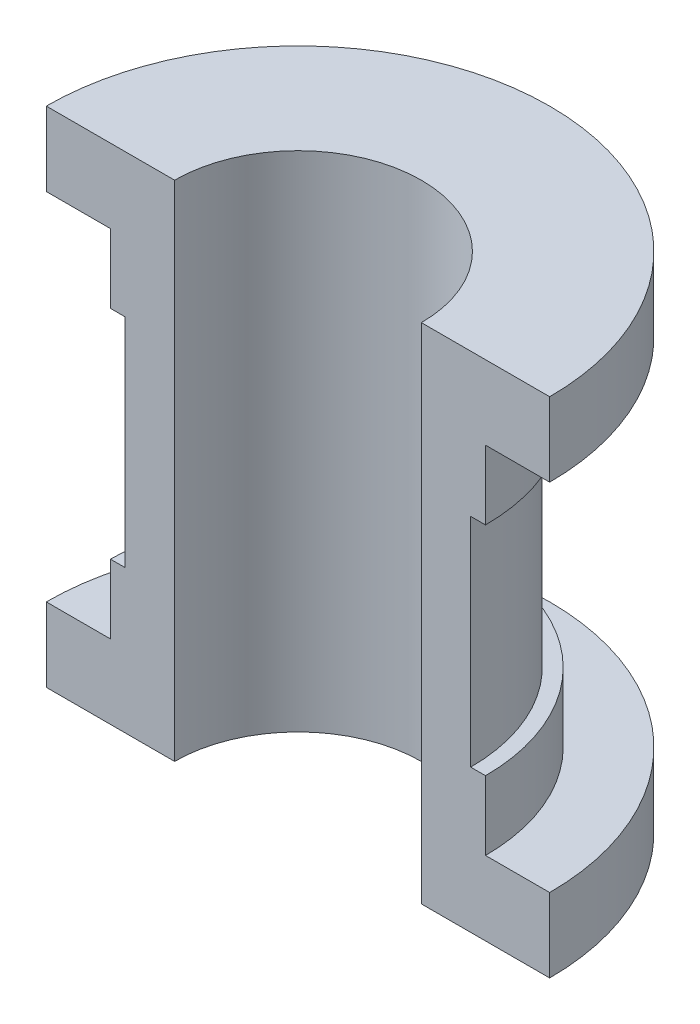
ISO-10303-21;
HEADER;
FILE_DESCRIPTION(('STEP AP214'),'2;1');
FILE_NAME('part.step','',(''),(''),'','','');
FILE_SCHEMA(('AUTOMOTIVE_DESIGN { 1 0 10303 214 1 1 1 1 }'));
ENDSEC;
DATA;
#1=APPLICATION_CONTEXT('core data for automotive mechanical design processes');
#2=APPLICATION_PROTOCOL_DEFINITION('international standard','automotive_design',2000,#1);
#3=PRODUCT_CONTEXT('',#1,'mechanical');
#4=PRODUCT('Part','Part','',(#3));
#5=PRODUCT_RELATED_PRODUCT_CATEGORY('part','',(#4));
#6=PRODUCT_DEFINITION_FORMATION('','',#4);
#7=PRODUCT_DEFINITION_CONTEXT('part definition',#1,'design');
#8=PRODUCT_DEFINITION('design','',#6,#7);
#9=PRODUCT_DEFINITION_SHAPE('','',#8);
#10=(LENGTH_UNIT() NAMED_UNIT(*) SI_UNIT(.MILLI.,.METRE.));
#11=(NAMED_UNIT(*) PLANE_ANGLE_UNIT() SI_UNIT($,.RADIAN.));
#12=(NAMED_UNIT(*) SI_UNIT($,.STERADIAN.) SOLID_ANGLE_UNIT());
#13=UNCERTAINTY_MEASURE_WITH_UNIT(LENGTH_MEASURE(1.E-05),#10,'distance_accuracy_value','');
#14=(GEOMETRIC_REPRESENTATION_CONTEXT(3) GLOBAL_UNCERTAINTY_ASSIGNED_CONTEXT((#13)) GLOBAL_UNIT_ASSIGNED_CONTEXT((#10,
#11,#12)) REPRESENTATION_CONTEXT('',''));
#15=CARTESIAN_POINT('',(0.,0.,0.));
#16=DIRECTION('',(0.,0.,1.));
#17=DIRECTION('',(1.,0.,0.));
#18=AXIS2_PLACEMENT_3D('',#15,#16,#17);
#19=CARTESIAN_POINT('',(0.,0.,0.));
#20=DIRECTION('',(0.,0.,-1.));
#21=DIRECTION('',(-1.,0.,0.));
#22=AXIS2_PLACEMENT_3D('',#19,#20,#21);
#23=PLANE('',#22);
#24=DIRECTION('',(-1.,0.,0.));
#25=VECTOR('',#24,1.);
#26=CARTESIAN_POINT('',(0.,0.,0.));
#27=LINE('',#26,#25);
#28=CARTESIAN_POINT('',(-12.5,0.,1.32676290876039E-13));
#29=VERTEX_POINT('',#28);
#30=CARTESIAN_POINT('',(-25.5,0.,1.78065548281E-13));
#31=VERTEX_POINT('',#30);
#32=EDGE_CURVE('E134',#29,#31,#27,.T.);
#33=ORIENTED_EDGE('',*,*,#32,.F.);
#34=DIRECTION('',(0.,1.,0.));
#35=VECTOR('',#34,1.);
#36=CARTESIAN_POINT('',(-12.5,0.,1.32676290876039E-13));
#37=LINE('',#36,#35);
#38=CARTESIAN_POINT('',(-12.5,51.,1.32676290876039E-13));
#39=VERTEX_POINT('',#38);
#40=EDGE_CURVE('E122',#29,#39,#37,.T.);
#41=ORIENTED_EDGE('',*,*,#40,.T.);
#42=DIRECTION('',(1.,0.,0.));
#43=VECTOR('',#42,1.);
#44=CARTESIAN_POINT('',(-25.5,51.,1.78065548281E-13));
#45=LINE('',#44,#43);
#46=CARTESIAN_POINT('',(-25.5,51.,1.78065548281E-13));
#47=VERTEX_POINT('',#46);
#48=EDGE_CURVE('E174',#47,#39,#45,.T.);
#49=ORIENTED_EDGE('',*,*,#48,.F.);
#50=DIRECTION('',(0.,1.,0.));
#51=VECTOR('',#50,1.);
#52=CARTESIAN_POINT('',(-25.5,43.5,1.78065548281E-13));
#53=LINE('',#52,#51);
#54=CARTESIAN_POINT('',(-25.5,43.5,1.78065548281E-13));
#55=VERTEX_POINT('',#54);
#56=EDGE_CURVE('E171',#55,#47,#53,.T.);
#57=ORIENTED_EDGE('',*,*,#56,.F.);
#58=DIRECTION('',(-1.,0.,0.));
#59=VECTOR('',#58,1.);
#60=CARTESIAN_POINT('',(-19.,43.5,1.32676290876039E-13));
#61=LINE('',#60,#59);
#62=CARTESIAN_POINT('',(-19.,43.5,1.32676290876039E-13));
#63=VERTEX_POINT('',#62);
#64=EDGE_CURVE('E168',#63,#55,#61,.T.);
#65=ORIENTED_EDGE('',*,*,#64,.F.);
#66=DIRECTION('',(0.,1.,0.));
#67=VECTOR('',#66,1.);
#68=CARTESIAN_POINT('',(-19.,36.5,1.32676290876039E-13));
#69=LINE('',#68,#67);
#70=CARTESIAN_POINT('',(-19.,36.5,1.32676290876039E-13));
#71=VERTEX_POINT('',#70);
#72=EDGE_CURVE('E165',#71,#63,#69,.T.);
#73=ORIENTED_EDGE('',*,*,#72,.F.);
#74=DIRECTION('',(-1.,0.,0.));
#75=VECTOR('',#74,1.);
#76=CARTESIAN_POINT('',(-17.5,36.5,1.2220184685951E-13));
#77=LINE('',#76,#75);
#78=CARTESIAN_POINT('',(-17.5,36.5,1.2220184685951E-13));
#79=VERTEX_POINT('',#78);
#80=EDGE_CURVE('E162',#79,#71,#77,.T.);
#81=ORIENTED_EDGE('',*,*,#80,.F.);
#82=DIRECTION('',(0.,1.,0.));
#83=VECTOR('',#82,1.);
#84=CARTESIAN_POINT('',(-17.5,14.5,1.2220184685951E-13));
#85=LINE('',#84,#83);
#86=CARTESIAN_POINT('',(-17.5,14.5,1.2220184685951E-13));
#87=VERTEX_POINT('',#86);
#88=EDGE_CURVE('E159',#87,#79,#85,.T.);
#89=ORIENTED_EDGE('',*,*,#88,.F.);
#90=DIRECTION('',(1.,0.,0.));
#91=VECTOR('',#90,1.);
#92=CARTESIAN_POINT('',(-19.,14.5,1.32676290876039E-13));
#93=LINE('',#92,#91);
#94=CARTESIAN_POINT('',(-19.,14.5,1.32676290876039E-13));
#95=VERTEX_POINT('',#94);
#96=EDGE_CURVE('E156',#95,#87,#93,.T.);
#97=ORIENTED_EDGE('',*,*,#96,.F.);
#98=DIRECTION('',(0.,1.,0.));
#99=VECTOR('',#98,1.);
#100=CARTESIAN_POINT('',(-19.,7.5,1.32676290876039E-13));
#101=LINE('',#100,#99);
#102=CARTESIAN_POINT('',(-19.,7.5,1.32676290876039E-13));
#103=VERTEX_POINT('',#102);
#104=EDGE_CURVE('E153',#103,#95,#101,.T.);
#105=ORIENTED_EDGE('',*,*,#104,.F.);
#106=DIRECTION('',(1.,0.,0.));
#107=VECTOR('',#106,1.);
#108=CARTESIAN_POINT('',(-25.5,7.5,1.78065548281E-13));
#109=LINE('',#108,#107);
#110=CARTESIAN_POINT('',(-25.5,7.5,1.78065548281E-13));
#111=VERTEX_POINT('',#110);
#112=EDGE_CURVE('E150',#111,#103,#109,.T.);
#113=ORIENTED_EDGE('',*,*,#112,.F.);
#114=DIRECTION('',(0.,1.,0.));
#115=VECTOR('',#114,1.);
#116=CARTESIAN_POINT('',(-25.5,0.,1.78065548281E-13));
#117=LINE('',#116,#115);
#118=EDGE_CURVE('E141',#31,#111,#117,.T.);
#119=ORIENTED_EDGE('',*,*,#118,.F.);
#120=EDGE_LOOP('',(#33,#41,#49,#57,#65,#73,#81,#89,#97,#105,#113,#119));
#121=FACE_BOUND('',#120,.T.);
#122=ADVANCED_FACE('F33',(#121),#23,.F.);
#123=CARTESIAN_POINT('',(0.,0.,0.));
#124=DIRECTION('',(0.,-1.,0.));
#125=DIRECTION('',(0.,0.,-1.));
#126=AXIS2_PLACEMENT_3D('',#123,#124,#125);
#127=PLANE('',#126);
#128=CARTESIAN_POINT('',(0.,0.,0.));
#129=DIRECTION('',(0.,1.,0.));
#130=DIRECTION('',(0.,0.,1.));
#131=AXIS2_PLACEMENT_3D('',#128,#129,#130);
#132=CIRCLE('',#131,12.5);
#133=CARTESIAN_POINT('',(12.5,0.,0.));
#134=VERTEX_POINT('',#133);
#135=EDGE_CURVE('E49',#134,#29,#132,.T.);
#136=ORIENTED_EDGE('',*,*,#135,.T.);
#137=ORIENTED_EDGE('',*,*,#32,.T.);
#138=CARTESIAN_POINT('',(0.,0.,0.));
#139=DIRECTION('',(0.,-1.,0.));
#140=DIRECTION('',(0.,0.,-1.));
#141=AXIS2_PLACEMENT_3D('',#138,#139,#140);
#142=CIRCLE('',#141,25.5);
#143=CARTESIAN_POINT('',(25.5,0.,0.));
#144=VERTEX_POINT('',#143);
#145=EDGE_CURVE('E37',#31,#144,#142,.T.);
#146=ORIENTED_EDGE('',*,*,#145,.T.);
#147=EDGE_CURVE('E136',#144,#134,#27,.T.);
#148=ORIENTED_EDGE('',*,*,#147,.T.);
#149=EDGE_LOOP('',(#136,#137,#146,#148));
#150=FACE_BOUND('',#149,.T.);
#151=ADVANCED_FACE('F35',(#150),#127,.T.);
#152=CARTESIAN_POINT('',(0.,0.,0.));
#153=DIRECTION('',(0.,-1.,0.));
#154=DIRECTION('',(0.,0.,-1.));
#155=AXIS2_PLACEMENT_3D('',#152,#153,#154);
#156=CYLINDRICAL_SURFACE('',#155,25.5);
#157=CARTESIAN_POINT('',(0.,7.5,0.));
#158=DIRECTION('',(0.,-1.,0.));
#159=DIRECTION('',(0.,0.,-1.));
#160=AXIS2_PLACEMENT_3D('',#157,#158,#159);
#161=CIRCLE('',#160,25.5);
#162=CARTESIAN_POINT('',(25.5,7.5,0.));
#163=VERTEX_POINT('',#162);
#164=EDGE_CURVE('E190',#111,#163,#161,.T.);
#165=ORIENTED_EDGE('',*,*,#164,.T.);
#166=DIRECTION('',(0.,1.,0.));
#167=VECTOR('',#166,1.);
#168=CARTESIAN_POINT('',(25.5,0.,0.));
#169=LINE('',#168,#167);
#170=EDGE_CURVE('E194',#144,#163,#169,.T.);
#171=ORIENTED_EDGE('',*,*,#170,.F.);
#172=ORIENTED_EDGE('',*,*,#145,.F.);
#173=ORIENTED_EDGE('',*,*,#118,.T.);
#174=EDGE_LOOP('',(#165,#171,#172,#173));
#175=FACE_BOUND('',#174,.T.);
#176=ADVANCED_FACE('F195',(#175),#156,.T.);
#177=CARTESIAN_POINT('',(-25.5,7.5,1.78065548281E-13));
#178=DIRECTION('',(0.,1.,0.));
#179=DIRECTION('',(0.,0.,1.));
#180=AXIS2_PLACEMENT_3D('',#177,#178,#179);
#181=PLANE('',#180);
#182=CARTESIAN_POINT('',(0.,7.5,0.));
#183=DIRECTION('',(0.,-1.,0.));
#184=DIRECTION('',(0.,0.,-1.));
#185=AXIS2_PLACEMENT_3D('',#182,#183,#184);
#186=CIRCLE('',#185,19.);
#187=CARTESIAN_POINT('',(19.,7.5,0.));
#188=VERTEX_POINT('',#187);
#189=EDGE_CURVE('E189',#103,#188,#186,.T.);
#190=ORIENTED_EDGE('',*,*,#189,.T.);
#191=DIRECTION('',(-1.,0.,0.));
#192=VECTOR('',#191,1.);
#193=CARTESIAN_POINT('',(25.5,7.5,0.));
#194=LINE('',#193,#192);
#195=EDGE_CURVE('E199',#163,#188,#194,.T.);
#196=ORIENTED_EDGE('',*,*,#195,.F.);
#197=ORIENTED_EDGE('',*,*,#164,.F.);
#198=ORIENTED_EDGE('',*,*,#112,.T.);
#199=EDGE_LOOP('',(#190,#196,#197,#198));
#200=FACE_BOUND('',#199,.T.);
#201=ADVANCED_FACE('F278',(#200),#181,.T.);
#202=CARTESIAN_POINT('',(0.,0.,0.));
#203=DIRECTION('',(0.,-1.,0.));
#204=DIRECTION('',(0.,0.,-1.));
#205=AXIS2_PLACEMENT_3D('',#202,#203,#204);
#206=CYLINDRICAL_SURFACE('',#205,19.);
#207=CARTESIAN_POINT('',(0.,14.5,0.));
#208=DIRECTION('',(0.,-1.,0.));
#209=DIRECTION('',(0.,0.,-1.));
#210=AXIS2_PLACEMENT_3D('',#207,#208,#209);
#211=CIRCLE('',#210,19.);
#212=CARTESIAN_POINT('',(19.,14.5,0.));
#213=VERTEX_POINT('',#212);
#214=EDGE_CURVE('E187',#95,#213,#211,.T.);
#215=ORIENTED_EDGE('',*,*,#214,.T.);
#216=DIRECTION('',(0.,1.,0.));
#217=VECTOR('',#216,1.);
#218=CARTESIAN_POINT('',(19.,7.5,0.));
#219=LINE('',#218,#217);
#220=EDGE_CURVE('E201',#188,#213,#219,.T.);
#221=ORIENTED_EDGE('',*,*,#220,.F.);
#222=ORIENTED_EDGE('',*,*,#189,.F.);
#223=ORIENTED_EDGE('',*,*,#104,.T.);
#224=EDGE_LOOP('',(#215,#221,#222,#223));
#225=FACE_BOUND('',#224,.T.);
#226=ADVANCED_FACE('F282',(#225),#206,.T.);
#227=CARTESIAN_POINT('',(-19.,14.5,1.32676290876039E-13));
#228=DIRECTION('',(0.,1.,0.));
#229=DIRECTION('',(0.,0.,1.));
#230=AXIS2_PLACEMENT_3D('',#227,#228,#229);
#231=PLANE('',#230);
#232=CARTESIAN_POINT('',(0.,14.5,0.));
#233=DIRECTION('',(0.,-1.,0.));
#234=DIRECTION('',(0.,0.,-1.));
#235=AXIS2_PLACEMENT_3D('',#232,#233,#234);
#236=CIRCLE('',#235,17.5);
#237=CARTESIAN_POINT('',(17.5,14.5,0.));
#238=VERTEX_POINT('',#237);
#239=EDGE_CURVE('E185',#87,#238,#236,.T.);
#240=ORIENTED_EDGE('',*,*,#239,.T.);
#241=DIRECTION('',(-1.,0.,0.));
#242=VECTOR('',#241,1.);
#243=CARTESIAN_POINT('',(19.,14.5,0.));
#244=LINE('',#243,#242);
#245=EDGE_CURVE('E207',#213,#238,#244,.T.);
#246=ORIENTED_EDGE('',*,*,#245,.F.);
#247=ORIENTED_EDGE('',*,*,#214,.F.);
#248=ORIENTED_EDGE('',*,*,#96,.T.);
#249=EDGE_LOOP('',(#240,#246,#247,#248));
#250=FACE_BOUND('',#249,.T.);
#251=ADVANCED_FACE('F269',(#250),#231,.T.);
#252=CARTESIAN_POINT('',(0.,0.,0.));
#253=DIRECTION('',(0.,-1.,0.));
#254=DIRECTION('',(0.,0.,-1.));
#255=AXIS2_PLACEMENT_3D('',#252,#253,#254);
#256=CYLINDRICAL_SURFACE('',#255,17.5);
#257=CARTESIAN_POINT('',(-3.00000000000012,25.5,-17.2409396495666));
#258=CARTESIAN_POINT('',(-2.99999334322031,25.667177539672,-17.2409427238107));
#259=CARTESIAN_POINT('',(-2.98597849080092,25.8344446101254,-17.2433975799678));
#260=CARTESIAN_POINT('',(-2.93031666162581,26.1642804472311,-17.2529421043199));
#261=CARTESIAN_POINT('',(-2.88864464929504,26.3268448176795,-17.2600359717149));
#262=CARTESIAN_POINT('',(-2.7789704603729,26.6424542964631,-17.2780319968807));
#263=CARTESIAN_POINT('',(-2.71099083852864,26.7955074291267,-17.2889308916418));
#264=CARTESIAN_POINT('',(-2.55068812102214,27.0880207093521,-17.313305084328));
#265=CARTESIAN_POINT('',(-2.45836757998611,27.2274822812718,-17.3267801118422));
#266=CARTESIAN_POINT('',(-2.25097753821779,27.4903223044961,-17.3549451758276));
#267=CARTESIAN_POINT('',(-2.13570381628929,27.6135385515967,-17.3696453757954));
#268=CARTESIAN_POINT('',(-1.88612097423872,27.8389804382051,-17.3985142730382));
#269=CARTESIAN_POINT('',(-1.75181070098539,27.9412048052191,-17.4126829380499));
#270=CARTESIAN_POINT('',(-1.46691308220618,28.1223728125349,-17.4390002009036));
#271=CARTESIAN_POINT('',(-1.31622811896224,28.2011650479544,-17.4511354492007));
#272=CARTESIAN_POINT('',(-1.00351837852206,28.332258502446,-17.4719053147098));
#273=CARTESIAN_POINT('',(-0.841494381888785,28.3845615429592,-17.4805401726063));
#274=CARTESIAN_POINT('',(-0.512382868410292,28.4606945792627,-17.4932645851018));
#275=CARTESIAN_POINT('',(-0.345360157307125,28.4847973287291,-17.4973976536598));
#276=CARTESIAN_POINT('',(-0.00959366953928641,28.5046941172434,-17.5008024112351));
#277=CARTESIAN_POINT('',(0.159149982803156,28.5004901869268,-17.500074448968));
#278=CARTESIAN_POINT('',(0.491702223591147,28.4641048892897,-17.4938735157789));
#279=CARTESIAN_POINT('',(0.655543993481105,28.4322170900692,-17.4884503360207));
#280=CARTESIAN_POINT('',(0.975516328537184,28.34183194212,-17.4735238964266));
#281=CARTESIAN_POINT('',(1.13164664814071,28.2833337466176,-17.4640205067542));
#282=CARTESIAN_POINT('',(1.43263245757691,28.1410992492112,-17.4419170029363));
#283=CARTESIAN_POINT('',(1.57743003521015,28.0572427740783,-17.4293021974191));
#284=CARTESIAN_POINT('',(1.85100900942152,27.8667602436002,-17.402375995437));
#285=CARTESIAN_POINT('',(1.97978903507638,27.7601322413861,-17.3880644539551));
#286=CARTESIAN_POINT('',(2.21941290689016,27.5255074487918,-17.3591182543925));
#287=CARTESIAN_POINT('',(2.33000539360493,27.3972540137573,-17.344481806616));
#288=CARTESIAN_POINT('',(2.52814283244124,27.1238815720677,-17.3167125731742));
#289=CARTESIAN_POINT('',(2.61568754736614,26.9787623918605,-17.3035798029848));
#290=CARTESIAN_POINT('',(2.76529859974521,26.6754772581137,-17.280303555666));
#291=CARTESIAN_POINT('',(2.82733330960193,26.5172953991855,-17.2701637936693));
#292=CARTESIAN_POINT('',(2.9238797577273,26.1925432643535,-17.2540820099746));
#293=CARTESIAN_POINT('',(2.95839406920559,26.0259737742578,-17.2481395958225));
#294=CARTESIAN_POINT('',(2.99856320128737,25.6914275217455,-17.2412016562194));
#295=CARTESIAN_POINT('',(3.00457695031037,25.5234950915231,-17.2401446099915));
#296=CARTESIAN_POINT('',(2.98853197620289,25.1890237871704,-17.2429330582016));
#297=CARTESIAN_POINT('',(2.96647440309369,25.0224848562329,-17.2467783518012));
#298=CARTESIAN_POINT('',(2.89521941159166,24.6966768102896,-17.258881270067));
#299=CARTESIAN_POINT('',(2.84620588243519,24.5373662686615,-17.2671089866899));
#300=CARTESIAN_POINT('',(2.72262364312892,24.2292198163269,-17.2870244527025));
#301=CARTESIAN_POINT('',(2.64805332503149,24.0803845654009,-17.2987124197934));
#302=CARTESIAN_POINT('',(2.47463177769383,23.7958196745146,-17.324373772823));
#303=CARTESIAN_POINT('',(2.37555125161573,23.660231715266,-17.3383682986708));
#304=CARTESIAN_POINT('',(2.15623532353624,23.4074775480445,-17.3670046347296));
#305=CARTESIAN_POINT('',(2.03599834380806,23.2903127151975,-17.3816464931541));
#306=CARTESIAN_POINT('',(1.77618954233145,23.0764134044469,-17.4101230054923));
#307=CARTESIAN_POINT('',(1.63641893008553,22.9799187420536,-17.4239469640735));
#308=CARTESIAN_POINT('',(1.34244211015555,22.8117814486846,-17.4490567338254));
#309=CARTESIAN_POINT('',(1.18823639022292,22.7401379783904,-17.4603426307116));
#310=CARTESIAN_POINT('',(0.870468175561482,22.6241068691877,-17.4790582835881));
#311=CARTESIAN_POINT('',(0.70695195881627,22.5795954340365,-17.4865055299022));
#312=CARTESIAN_POINT('',(0.374626699017786,22.5186939997057,-17.4967788729714));
#313=CARTESIAN_POINT('',(0.205818119141441,22.5023015465667,-17.4996053729806));
#314=CARTESIAN_POINT('',(-0.129988654143676,22.4981772648257,-17.5003125469087));
#315=CARTESIAN_POINT('',(-0.296982352593409,22.5100811500724,-17.4982560843078));
#316=CARTESIAN_POINT('',(-0.626554113404435,22.5614215364439,-17.4895572282875));
#317=CARTESIAN_POINT('',(-0.789132204057355,22.60085786112,-17.4829148642581));
#318=CARTESIAN_POINT('',(-1.10510688506279,22.7060007997331,-17.4657883771442));
#319=CARTESIAN_POINT('',(-1.25851463077414,22.7716747169591,-17.4553090369673));
#320=CARTESIAN_POINT('',(-1.55218949226281,22.9273874100597,-17.4316504514312));
#321=CARTESIAN_POINT('',(-1.69245592673025,23.0174274482532,-17.4184710662012));
#322=CARTESIAN_POINT('',(-1.95769741806001,23.2205997890843,-17.390671178074));
#323=CARTESIAN_POINT('',(-2.08246711008165,23.3339981045831,-17.3760351790944));
#324=CARTESIAN_POINT('',(-2.31133475460787,23.5801109063648,-17.3470767953718));
#325=CARTESIAN_POINT('',(-2.41542785732067,23.7128299117867,-17.3327544849053));
#326=CARTESIAN_POINT('',(-2.60071215805779,23.9950065067107,-17.305928230343));
#327=CARTESIAN_POINT('',(-2.681724887082,24.1445826820249,-17.2934388002337));
#328=CARTESIAN_POINT('',(-2.81734831228009,24.4553768945044,-17.271864523511));
#329=CARTESIAN_POINT('',(-2.87198506892164,24.6165832587827,-17.2627763183618));
#330=CARTESIAN_POINT('',(-2.94160477458973,24.8986548435539,-17.2510229398288));
#331=CARTESIAN_POINT('',(-2.96346733737604,25.017823678506,-17.2472630378548));
#332=CARTESIAN_POINT('',(-2.99266721494131,25.2579793905963,-17.2422203045731));
#333=CARTESIAN_POINT('',(-3.0000048193984,25.3789662314288,-17.2409374238649));
#334=CARTESIAN_POINT('',(-3.00000000000012,25.5,-17.2409396495666));
#335=B_SPLINE_CURVE_WITH_KNOTS('',3,(#257,#258,#259,#260,#261,#262,#263,#264,#265,#266,#267,
#268,#269,#270,#271,#272,#273,#274,#275,#276,#277,#278,#279,#280,#281,#282,#283,#284,#285,#286,
#287,#288,#289,#290,#291,#292,#293,#294,#295,#296,#297,#298,#299,#300,#301,#302,#303,#304,#305,
#306,#307,#308,#309,#310,#311,#312,#313,#314,#315,#316,#317,#318,#319,#320,#321,#322,#323,#324,
#325,#326,#327,#328,#329,#330,#331,#332,#333,#334),.UNSPECIFIED.,.T.,.F.,(4,2,2,2,2,2,2,2,2,2,2,
2,2,2,2,2,2,2,2,2,2,2,2,2,2,2,2,2,2,2,2,2,2,2,2,2,2,2,4),(0.,0.501089951588281,1.00263411527872,
1.50374923087268,2.00481177439394,2.51054946507384,3.01631780370884,3.52528645944317,
4.03422011289577,4.5381895582309,5.04212285070943,5.54077666683348,6.03944635181164,
6.54051729263446,7.0416310900563,7.54917511935568,8.05672437185111,8.56490100620875,
9.07303011950975,9.574742675659,10.076434678393,10.5747459232883,11.0730885260168,
11.576282258526,12.0795135322501,12.588300132801,13.0970695480364,13.6034998598,
14.1098859728562,14.6097882655281,15.1096873544766,15.6089654137018,16.1082693436371,
16.6136095803368,17.1190682073767,17.6283353233665,18.1370982288975,18.4998862860552,
18.8626671078861),.UNSPECIFIED.);
#336=CARTESIAN_POINT('',(-3.00000000000012,25.5,-17.2409396495666));
#337=VERTEX_POINT('',#336);
#338=EDGE_CURVE('E11',#337,#337,#335,.T.);
#339=ORIENTED_EDGE('',*,*,#338,.F.);
#340=EDGE_LOOP('',(#339));
#341=FACE_BOUND('',#340,.T.);
#342=CARTESIAN_POINT('',(0.,36.5,0.));
#343=DIRECTION('',(0.,-1.,0.));
#344=DIRECTION('',(0.,0.,-1.));
#345=AXIS2_PLACEMENT_3D('',#342,#343,#344);
#346=CIRCLE('',#345,17.5);
#347=CARTESIAN_POINT('',(17.5,36.5,0.));
#348=VERTEX_POINT('',#347);
#349=EDGE_CURVE('E183',#79,#348,#346,.T.);
#350=ORIENTED_EDGE('',*,*,#349,.T.);
#351=DIRECTION('',(0.,1.,0.));
#352=VECTOR('',#351,1.);
#353=CARTESIAN_POINT('',(17.5,14.5,0.));
#354=LINE('',#353,#352);
#355=EDGE_CURVE('E210',#238,#348,#354,.T.);
#356=ORIENTED_EDGE('',*,*,#355,.F.);
#357=ORIENTED_EDGE('',*,*,#239,.F.);
#358=ORIENTED_EDGE('',*,*,#88,.T.);
#359=EDGE_LOOP('',(#350,#356,#357,#358));
#360=FACE_BOUND('',#359,.T.);
#361=ADVANCED_FACE('F238',(#341,#360),#256,.T.);
#362=CARTESIAN_POINT('',(-17.5,36.5,1.2220184685951E-13));
#363=DIRECTION('',(0.,-1.,0.));
#364=DIRECTION('',(0.,0.,-1.));
#365=AXIS2_PLACEMENT_3D('',#362,#363,#364);
#366=PLANE('',#365);
#367=CARTESIAN_POINT('',(0.,36.5,0.));
#368=DIRECTION('',(0.,-1.,0.));
#369=DIRECTION('',(0.,0.,-1.));
#370=AXIS2_PLACEMENT_3D('',#367,#368,#369);
#371=CIRCLE('',#370,19.);
#372=CARTESIAN_POINT('',(19.,36.5,0.));
#373=VERTEX_POINT('',#372);
#374=EDGE_CURVE('E181',#71,#373,#371,.T.);
#375=ORIENTED_EDGE('',*,*,#374,.T.);
#376=DIRECTION('',(1.,0.,0.));
#377=VECTOR('',#376,1.);
#378=CARTESIAN_POINT('',(17.5,36.5,0.));
#379=LINE('',#378,#377);
#380=EDGE_CURVE('E213',#348,#373,#379,.T.);
#381=ORIENTED_EDGE('',*,*,#380,.F.);
#382=ORIENTED_EDGE('',*,*,#349,.F.);
#383=ORIENTED_EDGE('',*,*,#80,.T.);
#384=EDGE_LOOP('',(#375,#381,#382,#383));
#385=FACE_BOUND('',#384,.T.);
#386=ADVANCED_FACE('F262',(#385),#366,.T.);
#387=CARTESIAN_POINT('',(0.,0.,0.));
#388=DIRECTION('',(0.,-1.,0.));
#389=DIRECTION('',(0.,0.,-1.));
#390=AXIS2_PLACEMENT_3D('',#387,#388,#389);
#391=CYLINDRICAL_SURFACE('',#390,19.);
#392=CARTESIAN_POINT('',(0.,43.5,0.));
#393=DIRECTION('',(0.,-1.,0.));
#394=DIRECTION('',(0.,0.,-1.));
#395=AXIS2_PLACEMENT_3D('',#392,#393,#394);
#396=CIRCLE('',#395,19.);
#397=CARTESIAN_POINT('',(19.,43.5,0.));
#398=VERTEX_POINT('',#397);
#399=EDGE_CURVE('E179',#63,#398,#396,.T.);
#400=ORIENTED_EDGE('',*,*,#399,.T.);
#401=DIRECTION('',(0.,1.,0.));
#402=VECTOR('',#401,1.);
#403=CARTESIAN_POINT('',(19.,36.5,0.));
#404=LINE('',#403,#402);
#405=EDGE_CURVE('E216',#373,#398,#404,.T.);
#406=ORIENTED_EDGE('',*,*,#405,.F.);
#407=ORIENTED_EDGE('',*,*,#374,.F.);
#408=ORIENTED_EDGE('',*,*,#72,.T.);
#409=EDGE_LOOP('',(#400,#406,#407,#408));
#410=FACE_BOUND('',#409,.T.);
#411=ADVANCED_FACE('F260',(#410),#391,.T.);
#412=CARTESIAN_POINT('',(-19.,43.5,1.32676290876039E-13));
#413=DIRECTION('',(0.,-1.,0.));
#414=DIRECTION('',(0.,0.,-1.));
#415=AXIS2_PLACEMENT_3D('',#412,#413,#414);
#416=PLANE('',#415);
#417=CARTESIAN_POINT('',(0.,43.5,0.));
#418=DIRECTION('',(0.,-1.,0.));
#419=DIRECTION('',(0.,0.,-1.));
#420=AXIS2_PLACEMENT_3D('',#417,#418,#419);
#421=CIRCLE('',#420,25.5);
#422=CARTESIAN_POINT('',(25.5,43.5,0.));
#423=VERTEX_POINT('',#422);
#424=EDGE_CURVE('E177',#55,#423,#421,.T.);
#425=ORIENTED_EDGE('',*,*,#424,.T.);
#426=DIRECTION('',(1.,0.,0.));
#427=VECTOR('',#426,1.);
#428=CARTESIAN_POINT('',(19.,43.5,0.));
#429=LINE('',#428,#427);
#430=EDGE_CURVE('E145',#398,#423,#429,.T.);
#431=ORIENTED_EDGE('',*,*,#430,.F.);
#432=ORIENTED_EDGE('',*,*,#399,.F.);
#433=ORIENTED_EDGE('',*,*,#64,.T.);
#434=EDGE_LOOP('',(#425,#431,#432,#433));
#435=FACE_BOUND('',#434,.T.);
#436=ADVANCED_FACE('F257',(#435),#416,.T.);
#437=CARTESIAN_POINT('',(0.,0.,0.));
#438=DIRECTION('',(0.,-1.,0.));
#439=DIRECTION('',(0.,0.,-1.));
#440=AXIS2_PLACEMENT_3D('',#437,#438,#439);
#441=CYLINDRICAL_SURFACE('',#440,25.5);
#442=CARTESIAN_POINT('',(0.,51.,0.));
#443=DIRECTION('',(0.,-1.,0.));
#444=DIRECTION('',(0.,0.,-1.));
#445=AXIS2_PLACEMENT_3D('',#442,#443,#444);
#446=CIRCLE('',#445,25.5);
#447=CARTESIAN_POINT('',(25.5,51.,0.));
#448=VERTEX_POINT('',#447);
#449=EDGE_CURVE('E57',#47,#448,#446,.T.);
#450=ORIENTED_EDGE('',*,*,#449,.T.);
#451=DIRECTION('',(0.,1.,0.));
#452=VECTOR('',#451,1.);
#453=CARTESIAN_POINT('',(25.5,43.5,0.));
#454=LINE('',#453,#452);
#455=EDGE_CURVE('E142',#423,#448,#454,.T.);
#456=ORIENTED_EDGE('',*,*,#455,.F.);
#457=ORIENTED_EDGE('',*,*,#424,.F.);
#458=ORIENTED_EDGE('',*,*,#56,.T.);
#459=EDGE_LOOP('',(#450,#456,#457,#458));
#460=FACE_BOUND('',#459,.T.);
#461=ADVANCED_FACE('F226',(#460),#441,.T.);
#462=CARTESIAN_POINT('',(-25.5,51.,1.78065548281E-13));
#463=DIRECTION('',(0.,1.,0.));
#464=DIRECTION('',(0.,0.,1.));
#465=AXIS2_PLACEMENT_3D('',#462,#463,#464);
#466=PLANE('',#465);
#467=CARTESIAN_POINT('',(0.,51.,0.));
#468=DIRECTION('',(0.,1.,0.));
#469=DIRECTION('',(0.,0.,1.));
#470=AXIS2_PLACEMENT_3D('',#467,#468,#469);
#471=CIRCLE('',#470,12.5);
#472=CARTESIAN_POINT('',(12.5,51.,0.));
#473=VERTEX_POINT('',#472);
#474=EDGE_CURVE('E125',#473,#39,#471,.T.);
#475=ORIENTED_EDGE('',*,*,#474,.F.);
#476=EDGE_CURVE('E173',#473,#448,#45,.T.);
#477=ORIENTED_EDGE('',*,*,#476,.T.);
#478=ORIENTED_EDGE('',*,*,#449,.F.);
#479=ORIENTED_EDGE('',*,*,#48,.T.);
#480=EDGE_LOOP('',(#475,#477,#478,#479));
#481=FACE_BOUND('',#480,.T.);
#482=ADVANCED_FACE('F229',(#481),#466,.T.);
#483=ORIENTED_EDGE('',*,*,#476,.F.);
#484=DIRECTION('',(0.,1.,0.));
#485=VECTOR('',#484,1.);
#486=CARTESIAN_POINT('',(12.5,0.,0.));
#487=LINE('',#486,#485);
#488=EDGE_CURVE('E129',#134,#473,#487,.T.);
#489=ORIENTED_EDGE('',*,*,#488,.F.);
#490=ORIENTED_EDGE('',*,*,#147,.F.);
#491=ORIENTED_EDGE('',*,*,#170,.T.);
#492=ORIENTED_EDGE('',*,*,#195,.T.);
#493=ORIENTED_EDGE('',*,*,#220,.T.);
#494=ORIENTED_EDGE('',*,*,#245,.T.);
#495=ORIENTED_EDGE('',*,*,#355,.T.);
#496=ORIENTED_EDGE('',*,*,#380,.T.);
#497=ORIENTED_EDGE('',*,*,#405,.T.);
#498=ORIENTED_EDGE('',*,*,#430,.T.);
#499=ORIENTED_EDGE('',*,*,#455,.T.);
#500=EDGE_LOOP('',(#483,#489,#490,#491,#492,#493,#494,#495,#496,#497,#498,#499));
#501=FACE_BOUND('',#500,.T.);
#502=ADVANCED_FACE('F222',(#501),#23,.F.);
#503=CARTESIAN_POINT('',(0.,0.,0.));
#504=DIRECTION('',(0.,1.,0.));
#505=DIRECTION('',(0.,0.,1.));
#506=AXIS2_PLACEMENT_3D('',#503,#504,#505);
#507=CYLINDRICAL_SURFACE('',#506,12.5);
#508=ORIENTED_EDGE('',*,*,#474,.T.);
#509=ORIENTED_EDGE('',*,*,#40,.F.);
#510=ORIENTED_EDGE('',*,*,#135,.F.);
#511=ORIENTED_EDGE('',*,*,#488,.T.);
#512=EDGE_LOOP('',(#508,#509,#510,#511));
#513=FACE_BOUND('',#512,.T.);
#514=ADVANCED_FACE('F123',(#513),#507,.F.);
#515=CARTESIAN_POINT('',(0.,25.5,0.00100000000035488));
#516=DIRECTION('',(0.,0.,-1.));
#517=DIRECTION('',(-1.,0.,0.));
#518=AXIS2_PLACEMENT_3D('',#515,#516,#517);
#519=CYLINDRICAL_SURFACE('',#518,3.);
#520=ORIENTED_EDGE('',*,*,#338,.T.);
#521=EDGE_LOOP('',(#520));
#522=FACE_BOUND('',#521,.T.);
#523=CARTESIAN_POINT('',(-1.64099622925627E-13,25.5,-23.5));
#524=DIRECTION('',(0.,0.,-1.));
#525=DIRECTION('',(-1.,0.,0.));
#526=AXIS2_PLACEMENT_3D('',#523,#524,#525);
#527=CIRCLE('',#526,3.);
#528=CARTESIAN_POINT('',(-3.00000000000016,25.5,-23.5));
#529=VERTEX_POINT('',#528);
#530=EDGE_CURVE('E230',#529,#529,#527,.T.);
#531=ORIENTED_EDGE('',*,*,#530,.F.);
#532=EDGE_LOOP('',(#531));
#533=FACE_BOUND('',#532,.T.);
#534=ADVANCED_FACE('F242',(#522,#533),#519,.T.);
#535=CARTESIAN_POINT('',(-1.64099622925627E-13,25.5,-23.5));
#536=DIRECTION('',(0.,0.,-1.));
#537=DIRECTION('',(-1.,0.,0.));
#538=AXIS2_PLACEMENT_3D('',#535,#536,#537);
#539=PLANE('',#538);
#540=ORIENTED_EDGE('',*,*,#530,.T.);
#541=EDGE_LOOP('',(#540));
#542=FACE_BOUND('',#541,.T.);
#543=ADVANCED_FACE('F247',(#542),#539,.T.);
#544=CLOSED_SHELL('',(#122,#151,#176,#201,#226,#251,#361,#386,#411,#436,#461,#482,#502,#514,
#534,#543));
#545=MANIFOLD_SOLID_BREP('B2',#544);
#546=ADVANCED_BREP_SHAPE_REPRESENTATION('',(#18,#545),#14);
#547=SHAPE_DEFINITION_REPRESENTATION(#9,#546);
ENDSEC;
END-ISO-10303-21;
